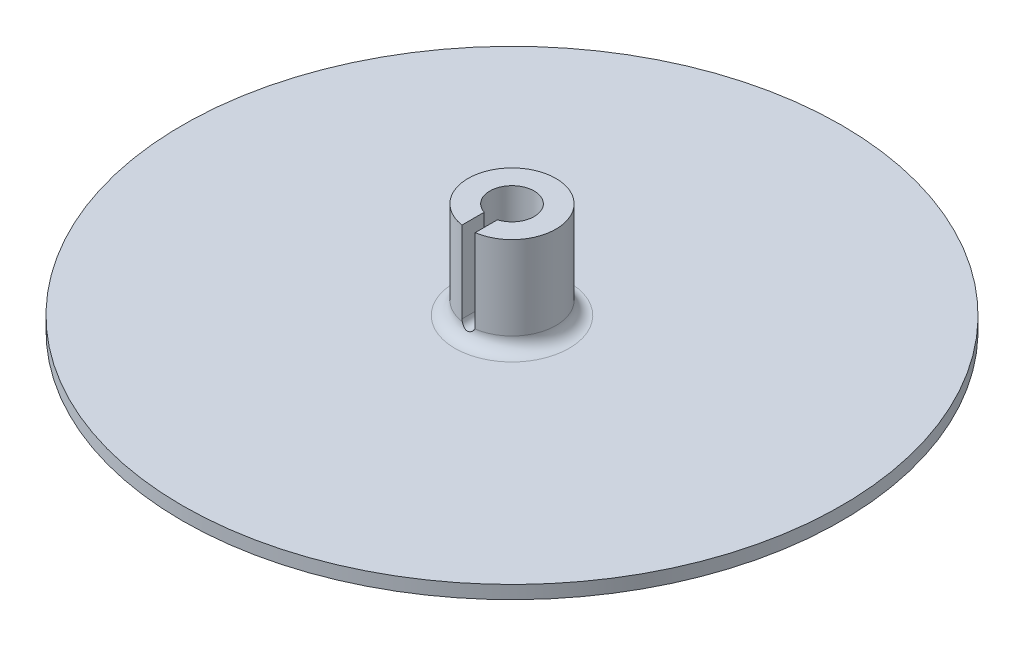
ISO-10303-21;
HEADER;
FILE_DESCRIPTION(('STEP AP214'),'2;1');
FILE_NAME('part.step','',(''),(''),'','','');
FILE_SCHEMA(('AUTOMOTIVE_DESIGN { 1 0 10303 214 1 1 1 1 }'));
ENDSEC;
DATA;
#1=APPLICATION_CONTEXT('core data for automotive mechanical design processes');
#2=APPLICATION_PROTOCOL_DEFINITION('international standard','automotive_design',2000,#1);
#3=PRODUCT_CONTEXT('',#1,'mechanical');
#4=PRODUCT('Part','Part','',(#3));
#5=PRODUCT_RELATED_PRODUCT_CATEGORY('part','',(#4));
#6=PRODUCT_DEFINITION_FORMATION('','',#4);
#7=PRODUCT_DEFINITION_CONTEXT('part definition',#1,'design');
#8=PRODUCT_DEFINITION('design','',#6,#7);
#9=PRODUCT_DEFINITION_SHAPE('','',#8);
#10=(LENGTH_UNIT() NAMED_UNIT(*) SI_UNIT(.MILLI.,.METRE.));
#11=(NAMED_UNIT(*) PLANE_ANGLE_UNIT() SI_UNIT($,.RADIAN.));
#12=(NAMED_UNIT(*) SI_UNIT($,.STERADIAN.) SOLID_ANGLE_UNIT());
#13=UNCERTAINTY_MEASURE_WITH_UNIT(LENGTH_MEASURE(1.E-05),#10,'distance_accuracy_value','');
#14=(GEOMETRIC_REPRESENTATION_CONTEXT(3) GLOBAL_UNCERTAINTY_ASSIGNED_CONTEXT((#13)) GLOBAL_UNIT_ASSIGNED_CONTEXT((#10,
#11,#12)) REPRESENTATION_CONTEXT('',''));
#15=CARTESIAN_POINT('',(0.,0.,0.));
#16=DIRECTION('',(0.,0.,1.));
#17=DIRECTION('',(1.,0.,0.));
#18=AXIS2_PLACEMENT_3D('',#15,#16,#17);
#19=CARTESIAN_POINT('',(0.,25.,0.));
#20=DIRECTION('',(0.,1.,0.));
#21=DIRECTION('',(0.,0.,1.));
#22=AXIS2_PLACEMENT_3D('',#19,#20,#21);
#23=PLANE('',#22);
#24=CARTESIAN_POINT('',(0.,25.,0.));
#25=DIRECTION('',(0.,1.,0.));
#26=DIRECTION('',(0.,0.,1.));
#27=AXIS2_PLACEMENT_3D('',#24,#25,#26);
#28=CIRCLE('',#27,10.);
#29=CARTESIAN_POINT('',(1.5,25.,9.8868599666426));
#30=VERTEX_POINT('',#29);
#31=CARTESIAN_POINT('',(-1.5,25.,9.8868599666426));
#32=VERTEX_POINT('',#31);
#33=EDGE_CURVE('E105',#30,#32,#28,.T.);
#34=ORIENTED_EDGE('',*,*,#33,.T.);
#35=DIRECTION('',(0.,0.,-1.));
#36=VECTOR('',#35,1.);
#37=CARTESIAN_POINT('',(-1.5,25.,75.));
#38=LINE('',#37,#36);
#39=CARTESIAN_POINT('',(-1.5,25.,4.82208461145177));
#40=VERTEX_POINT('',#39);
#41=EDGE_CURVE('E189',#32,#40,#38,.T.);
#42=ORIENTED_EDGE('',*,*,#41,.T.);
#43=CARTESIAN_POINT('',(0.,25.,0.));
#44=DIRECTION('',(0.,1.,0.));
#45=DIRECTION('',(0.,0.,1.));
#46=AXIS2_PLACEMENT_3D('',#43,#44,#45);
#47=CIRCLE('',#46,5.05);
#48=CARTESIAN_POINT('',(1.5,25.,4.82208461145177));
#49=VERTEX_POINT('',#48);
#50=EDGE_CURVE('E108',#49,#40,#47,.T.);
#51=ORIENTED_EDGE('',*,*,#50,.F.);
#52=DIRECTION('',(0.,0.,-1.));
#53=VECTOR('',#52,1.);
#54=CARTESIAN_POINT('',(1.5,25.,75.));
#55=LINE('',#54,#53);
#56=EDGE_CURVE('E99',#30,#49,#55,.T.);
#57=ORIENTED_EDGE('',*,*,#56,.F.);
#58=EDGE_LOOP('',(#34,#42,#51,#57));
#59=FACE_BOUND('',#58,.T.);
#60=ADVANCED_FACE('F33',(#59),#23,.T.);
#61=CARTESIAN_POINT('',(0.,25.,0.));
#62=DIRECTION('',(0.,-1.,0.));
#63=DIRECTION('',(0.,0.,-1.));
#64=AXIS2_PLACEMENT_3D('',#61,#62,#63);
#65=CYLINDRICAL_SURFACE('',#64,10.);
#66=DIRECTION('',(0.,-1.,0.));
#67=VECTOR('',#66,1.);
#68=CARTESIAN_POINT('',(-1.5,25.,9.88685996664259));
#69=LINE('',#68,#67);
#70=CARTESIAN_POINT('',(-1.5,6.5,9.88685996664259));
#71=VERTEX_POINT('',#70);
#72=EDGE_CURVE('E106',#32,#71,#69,.T.);
#73=ORIENTED_EDGE('',*,*,#72,.F.);
#74=ORIENTED_EDGE('',*,*,#33,.F.);
#75=DIRECTION('',(0.,-1.,0.));
#76=VECTOR('',#75,1.);
#77=CARTESIAN_POINT('',(1.5,25.,9.88685996664259));
#78=LINE('',#77,#76);
#79=CARTESIAN_POINT('',(1.5,6.5,9.8868599666426));
#80=VERTEX_POINT('',#79);
#81=EDGE_CURVE('E95',#80,#30,#78,.F.);
#82=ORIENTED_EDGE('',*,*,#81,.F.);
#83=CARTESIAN_POINT('',(1.4142135623731,6.,9.89949493661167));
#84=CARTESIAN_POINT('',(1.42841919297155,6.04016585919419,9.8974638851992));
#85=CARTESIAN_POINT('',(1.44090836451784,6.08094961701925,9.89565018448272));
#86=CARTESIAN_POINT('',(1.46229862087134,6.16314738232737,9.89251266828498));
#87=CARTESIAN_POINT('',(1.47122523286225,6.20455461573,9.89118537333465));
#88=CARTESIAN_POINT('',(1.48554469257614,6.28798936841882,9.88904494908769));
#89=CARTESIAN_POINT('',(1.4909375166604,6.33001689185242,9.88823182323051));
#90=CARTESIAN_POINT('',(1.49818071613181,6.4146943707577,9.8871359875291));
#91=CARTESIAN_POINT('',(1.5000047503228,6.45734663068889,9.88685722209615));
#92=CARTESIAN_POINT('',(1.5,6.5,9.88685996664259));
#93=B_SPLINE_CURVE_WITH_KNOTS('',3,(#83,#84,#85,#86,#87,#88,#89,#90,#91,#92),.UNSPECIFIED.,.F.,
.F.,(4,2,2,2,4),(0.,0.12791761598587,0.254901444701038,0.381886122846154,0.509804589424821),.UNSPECIFIED.);
#94=CARTESIAN_POINT('',(1.4142135623731,6.,9.89949493661167));
#95=VERTEX_POINT('',#94);
#96=EDGE_CURVE('E81',#95,#80,#93,.T.);
#97=ORIENTED_EDGE('',*,*,#96,.F.);
#98=CARTESIAN_POINT('',(0.,6.,0.));
#99=DIRECTION('',(0.,1.,0.));
#100=DIRECTION('',(0.,0.,1.));
#101=AXIS2_PLACEMENT_3D('',#98,#99,#100);
#102=CIRCLE('',#101,10.);
#103=CARTESIAN_POINT('',(-1.41421356237309,6.,9.89949493661167));
#104=VERTEX_POINT('',#103);
#105=EDGE_CURVE('E130',#95,#104,#102,.T.);
#106=ORIENTED_EDGE('',*,*,#105,.T.);
#107=CARTESIAN_POINT('',(-1.5,6.5,9.88685996664259));
#108=CARTESIAN_POINT('',(-1.50000475032279,6.45734663068889,9.88685722209615));
#109=CARTESIAN_POINT('',(-1.49818071613181,6.4146943707577,9.8871359875291));
#110=CARTESIAN_POINT('',(-1.49093751666039,6.33001689185242,9.88823182323051));
#111=CARTESIAN_POINT('',(-1.48554469257614,6.28798936841882,9.88904494908769));
#112=CARTESIAN_POINT('',(-1.47122523286225,6.20455461573,9.89118537333466));
#113=CARTESIAN_POINT('',(-1.46229862087134,6.16314738232737,9.89251266828498));
#114=CARTESIAN_POINT('',(-1.44090836451783,6.08094961701925,9.89565018448272));
#115=CARTESIAN_POINT('',(-1.42841919297154,6.04016585919419,9.8974638851992));
#116=CARTESIAN_POINT('',(-1.41421356237309,6.,9.89949493661167));
#117=B_SPLINE_CURVE_WITH_KNOTS('',3,(#107,#108,#109,#110,#111,#112,#113,#114,#115,#116),
.UNSPECIFIED.,.F.,.F.,(4,2,2,2,4),(0.,0.127918466578666,0.254903144723783,0.381886973438951,
0.509804589424821),.UNSPECIFIED.);
#118=EDGE_CURVE('E50',#71,#104,#117,.T.);
#119=ORIENTED_EDGE('',*,*,#118,.F.);
#120=EDGE_LOOP('',(#73,#74,#82,#97,#106,#119));
#121=FACE_BOUND('',#120,.T.);
#122=ADVANCED_FACE('F103',(#121),#65,.T.);
#123=CARTESIAN_POINT('',(0.,25.,0.));
#124=DIRECTION('',(0.,-1.,0.));
#125=DIRECTION('',(0.,0.,-1.));
#126=AXIS2_PLACEMENT_3D('',#123,#124,#125);
#127=CYLINDRICAL_SURFACE('',#126,5.05);
#128=CARTESIAN_POINT('',(0.,3.,0.));
#129=DIRECTION('',(0.,1.,0.));
#130=DIRECTION('',(0.,0.,1.));
#131=AXIS2_PLACEMENT_3D('',#128,#129,#130);
#132=CIRCLE('',#131,5.05);
#133=CARTESIAN_POINT('',(0.,3.,5.05));
#134=VERTEX_POINT('',#133);
#135=EDGE_CURVE('E125',#134,#134,#132,.F.);
#136=ORIENTED_EDGE('',*,*,#135,.T.);
#137=EDGE_LOOP('',(#136));
#138=FACE_BOUND('',#137,.T.);
#139=ORIENTED_EDGE('',*,*,#50,.T.);
#140=DIRECTION('',(0.,-1.,0.));
#141=VECTOR('',#140,1.);
#142=CARTESIAN_POINT('',(-1.5,25.,4.82208461145177));
#143=LINE('',#142,#141);
#144=CARTESIAN_POINT('',(-1.5,6.5,4.82208461145178));
#145=VERTEX_POINT('',#144);
#146=EDGE_CURVE('E11',#40,#145,#143,.T.);
#147=ORIENTED_EDGE('',*,*,#146,.T.);
#148=CARTESIAN_POINT('',(-1.5,6.5,4.82208461145178));
#149=CARTESIAN_POINT('',(-1.50000083113393,6.45880021036658,4.82208114095214));
#150=CARTESIAN_POINT('',(-1.49830148985582,6.41762115105425,4.82261329667609));
#151=CARTESIAN_POINT('',(-1.49152941200435,6.3355769487996,4.82471333733768));
#152=CARTESIAN_POINT('',(-1.4864574213053,6.29471173846925,4.82628099327));
#153=CARTESIAN_POINT('',(-1.4662672646696,6.17324184390769,4.83247036073428));
#154=CARTESIAN_POINT('',(-1.44617448514634,6.09348139109429,4.83857894888266));
#155=CARTESIAN_POINT('',(-1.39341281883227,5.93866328107021,4.85403390578543));
#156=CARTESIAN_POINT('',(-1.36074812347342,5.8636040661708,4.86337919533124));
#157=CARTESIAN_POINT('',(-1.2838235735082,5.71997772606621,4.88424823575082));
#158=CARTESIAN_POINT('',(-1.23955846920151,5.65141355933378,4.89577297226213));
#159=CARTESIAN_POINT('',(-1.13923445421656,5.5206505997195,4.92009916745428));
#160=CARTESIAN_POINT('',(-1.08288076919656,5.45868297246623,4.93292728818376));
#161=CARTESIAN_POINT('',(-0.96060720524951,5.34492068382514,4.95818776011715));
#162=CARTESIAN_POINT('',(-0.894685719882666,5.29312773421591,4.97062004443158));
#163=CARTESIAN_POINT('',(-0.753499488398171,5.20018355693814,4.99399170110133));
#164=CARTESIAN_POINT('',(-0.678072672041147,5.1592688738011,5.00489577354421));
#165=CARTESIAN_POINT('',(-0.521033737298645,5.09079588673565,5.02367061587903));
#166=CARTESIAN_POINT('',(-0.439423195338829,5.06323419187082,5.03154215576602));
#167=CARTESIAN_POINT('',(-0.274761638105901,5.02301464392478,5.04317598620987));
#168=CARTESIAN_POINT('',(-0.191815344013148,5.00996019178055,5.04704741153989));
#169=CARTESIAN_POINT('',(-0.0248238071827555,4.9978721191848,5.05062892909833));
#170=CARTESIAN_POINT('',(0.059221229127352,4.99883590181252,5.05033979208373));
#171=CARTESIAN_POINT('',(0.223240886422194,5.01449006325889,5.04571000416911));
#172=CARTESIAN_POINT('',(0.303260654722891,5.02875080240631,5.0414961693844));
#173=CARTESIAN_POINT('',(0.45971438764924,5.06989277604024,5.02964423703177));
#174=CARTESIAN_POINT('',(0.536148165504498,5.09677466707776,5.02200596132573));
#175=CARTESIAN_POINT('',(0.684290222124004,5.16269052408165,5.00398680727789));
#176=CARTESIAN_POINT('',(0.755933956718131,5.20186084841235,4.99357536252797));
#177=CARTESIAN_POINT('',(0.891768780147766,5.29113382804221,4.97111608758135));
#178=CARTESIAN_POINT('',(0.955958226917691,5.34123888512319,4.95906789809832));
#179=CARTESIAN_POINT('',(1.07762166302624,5.45318587148777,4.93408925495036));
#180=CARTESIAN_POINT('',(1.13475094534282,5.51539927529572,4.92114266459012));
#181=CARTESIAN_POINT('',(1.23787326290002,5.64866653032094,4.89622227592338));
#182=CARTESIAN_POINT('',(1.28386307041372,5.71972293484168,4.88424876023705));
#183=CARTESIAN_POINT('',(1.36375684651581,5.8695646559276,4.86255117944283));
#184=CARTESIAN_POINT('',(1.39753858215453,5.94841858636755,4.85285018932225));
#185=CARTESIAN_POINT('',(1.45120180384091,6.1110080353834,4.83707644462356));
#186=CARTESIAN_POINT('',(1.47110450722522,6.19473588975919,4.83099815398125));
#187=CARTESIAN_POINT('',(1.48913579644576,6.31603576786345,4.82545326192492));
#188=CARTESIAN_POINT('',(1.4932094742528,6.35272606915173,4.82419275325381));
#189=CARTESIAN_POINT('',(1.49863910020369,6.42627140138811,4.82250834680984));
#190=CARTESIAN_POINT('',(1.49999907805143,6.46312610651307,4.8220832085695));
#191=CARTESIAN_POINT('',(1.5,6.5,4.82208461145177));
#192=B_SPLINE_CURVE_WITH_KNOTS('',3,(#148,#149,#150,#151,#152,#153,#154,#155,#156,#157,#158,
#159,#160,#161,#162,#163,#164,#165,#166,#167,#168,#169,#170,#171,#172,#173,#174,#175,#176,#177,
#178,#179,#180,#181,#182,#183,#184,#185,#186,#187,#188,#189,#190,#191),.UNSPECIFIED.,.F.,.F.,(4,
2,2,2,2,2,2,2,2,2,2,2,2,2,2,2,2,2,2,2,2,4),(0.,0.123520293443045,0.247013278982539,
0.493165886849912,0.739236499304448,0.985418662516604,1.23847415475121,1.49157218442165,
1.74979170029462,2.00794560796788,2.25885381637513,2.50971554386333,2.75274253057542,
2.99578216092711,3.24162021627833,3.48751232367817,3.74268099875394,3.99792352220966,
4.25565513435547,4.51299187475599,4.6237126569851,4.73426890186612),.UNSPECIFIED.);
#193=CARTESIAN_POINT('',(1.5,6.5,4.82208461145177));
#194=VERTEX_POINT('',#193);
#195=EDGE_CURVE('E91',#145,#194,#192,.T.);
#196=ORIENTED_EDGE('',*,*,#195,.T.);
#197=DIRECTION('',(0.,-1.,0.));
#198=VECTOR('',#197,1.);
#199=CARTESIAN_POINT('',(1.5,25.,4.82208461145177));
#200=LINE('',#199,#198);
#201=EDGE_CURVE('E43',#194,#49,#200,.F.);
#202=ORIENTED_EDGE('',*,*,#201,.T.);
#203=EDGE_LOOP('',(#139,#147,#196,#202));
#204=FACE_BOUND('',#203,.T.);
#205=ADVANCED_FACE('F165',(#138,#204),#127,.F.);
#206=CARTESIAN_POINT('',(0.,6.,0.));
#207=DIRECTION('',(0.,1.,0.));
#208=DIRECTION('',(0.,0.,1.));
#209=AXIS2_PLACEMENT_3D('',#206,#207,#208);
#210=TOROIDAL_SURFACE('',#209,13.,3.);
#211=CARTESIAN_POINT('',(0.,3.,0.));
#212=DIRECTION('',(0.,1.,0.));
#213=DIRECTION('',(0.,0.,1.));
#214=AXIS2_PLACEMENT_3D('',#211,#212,#213);
#215=CIRCLE('',#214,13.);
#216=CARTESIAN_POINT('',(0.,3.,13.));
#217=VERTEX_POINT('',#216);
#218=EDGE_CURVE('E132',#217,#217,#215,.F.);
#219=ORIENTED_EDGE('',*,*,#218,.F.);
#220=EDGE_LOOP('',(#219));
#221=FACE_BOUND('',#220,.T.);
#222=CARTESIAN_POINT('',(-1.4142842571421,6.0002,9.89948484383573));
#223=CARTESIAN_POINT('',(-1.40060480515787,5.9614843709103,9.90143226526426));
#224=CARTESIAN_POINT('',(-1.38535647512993,5.92340510075655,9.90434095059942));
#225=CARTESIAN_POINT('',(-1.35188374135329,5.84878546790682,9.91182889951746));
#226=CARTESIAN_POINT('',(-1.3336618830547,5.81224382230925,9.91640673834471));
#227=CARTESIAN_POINT('',(-1.27494708148976,5.70560431855961,9.93221841420121));
#228=CARTESIAN_POINT('',(-1.23025682025258,5.6380772685519,9.9455563769499));
#229=CARTESIAN_POINT('',(-1.13127254345632,5.51173921922514,9.97549868000922));
#230=CARTESIAN_POINT('',(-1.07700602350915,5.45290412891045,9.99209368352703));
#231=CARTESIAN_POINT('',(-0.959919333410373,5.34461202366505,10.0262739045994));
#232=CARTESIAN_POINT('',(-0.897085911497275,5.2951698274809,10.0438606309938));
#233=CARTESIAN_POINT('',(-0.75920743245176,5.2034852329578,10.0789623106131));
#234=CARTESIAN_POINT('',(-0.683604425533763,5.16203832460585,10.096377126458));
#235=CARTESIAN_POINT('',(-0.52571456648518,5.09250222462331,10.1269949538265));
#236=CARTESIAN_POINT('',(-0.443433220436748,5.0644021573282,10.140201391646));
#237=CARTESIAN_POINT('',(-0.277967962078202,5.02362366582018,10.1597749555894));
#238=CARTESIAN_POINT('',(-0.194961571734607,5.01035642877221,10.1664019441546));
#239=CARTESIAN_POINT('',(-0.0276544944238265,4.99791462333012,10.1726080872463));
#240=CARTESIAN_POINT('',(0.0566454347636087,4.99873209676839,10.1721912217063));
#241=CARTESIAN_POINT('',(0.215908030638047,5.01366494786572,10.1647616050232));
#242=CARTESIAN_POINT('',(0.291019113663042,5.02655636316445,10.1583560461505));
#243=CARTESIAN_POINT('',(0.437891905022995,5.06334248259628,10.140721993753));
#244=CARTESIAN_POINT('',(0.50965295690038,5.08723933342155,10.129492559324));
#245=CARTESIAN_POINT('',(0.65053429965542,5.14617939646366,10.1032331240305));
#246=CARTESIAN_POINT('',(0.719489824955033,5.18156373031601,10.0880901522306));
#247=CARTESIAN_POINT('',(0.850918831290719,5.26230312309961,10.0560977947511));
#248=CARTESIAN_POINT('',(0.913385976354351,5.30766779565804,10.0392467722786));
#249=CARTESIAN_POINT('',(1.0366656264176,5.41256019935839,10.0041871297365));
#250=CARTESIAN_POINT('',(1.09666563055016,5.47305846895193,9.98601446131202));
#251=CARTESIAN_POINT('',(1.20584202550895,5.60380383672188,9.95292194643777));
#252=CARTESIAN_POINT('',(1.25504029703453,5.67403074806011,9.93799552476742));
#253=CARTESIAN_POINT('',(1.32113891946382,5.78815639079217,9.91965846163283));
#254=CARTESIAN_POINT('',(1.34245212120577,5.82920665637699,9.91411482094646));
#255=CARTESIAN_POINT('',(1.38127745055326,5.91329693337138,9.9051294708537));
#256=CARTESIAN_POINT('',(1.39878854571011,5.95633748139617,9.90168833191529));
#257=CARTESIAN_POINT('',(1.41428425714211,6.0002,9.89948484383573));
#258=B_SPLINE_CURVE_WITH_KNOTS('',3,(#222,#223,#224,#225,#226,#227,#228,#229,#230,#231,#232,
#233,#234,#235,#236,#237,#238,#239,#240,#241,#242,#243,#244,#245,#246,#247,#248,#249,#250,#251,
#252,#253,#254,#255,#256,#257),.UNSPECIFIED.,.F.,.F.,(4,2,2,2,2,2,2,2,2,2,2,2,2,2,2,2,2,4),(0.,
0.123220809219006,0.246336684939518,0.491264222404226,0.73549963208605,0.980117218033315,
1.24270076491599,1.5050699771325,1.75660676586695,2.00800143551067,2.23638676226301,
2.46481665615475,2.70076839659846,2.93694842207608,3.19711723572144,3.4567540697702,
3.59628686897101,3.7358575105578),.UNSPECIFIED.);
#259=EDGE_CURVE('E86',#104,#95,#258,.T.);
#260=ORIENTED_EDGE('',*,*,#259,.F.);
#261=ORIENTED_EDGE('',*,*,#105,.F.);
#262=EDGE_LOOP('',(#260,#261));
#263=FACE_BOUND('',#262,.T.);
#264=ADVANCED_FACE('F35',(#221,#263),#210,.F.);
#265=CARTESIAN_POINT('',(0.,3.,0.));
#266=DIRECTION('',(0.,-1.,0.));
#267=DIRECTION('',(0.,0.,-1.));
#268=AXIS2_PLACEMENT_3D('',#265,#266,#267);
#269=CYLINDRICAL_SURFACE('',#268,75.);
#270=CARTESIAN_POINT('',(0.,3.,0.));
#271=DIRECTION('',(0.,1.,0.));
#272=DIRECTION('',(0.,0.,1.));
#273=AXIS2_PLACEMENT_3D('',#270,#271,#272);
#274=CIRCLE('',#273,75.);
#275=CARTESIAN_POINT('',(0.,3.,75.));
#276=VERTEX_POINT('',#275);
#277=EDGE_CURVE('E122',#276,#276,#274,.T.);
#278=ORIENTED_EDGE('',*,*,#277,.F.);
#279=EDGE_LOOP('',(#278));
#280=FACE_BOUND('',#279,.T.);
#281=CARTESIAN_POINT('',(0.,0.,0.));
#282=DIRECTION('',(0.,1.,0.));
#283=DIRECTION('',(0.,0.,1.));
#284=AXIS2_PLACEMENT_3D('',#281,#282,#283);
#285=CIRCLE('',#284,75.);
#286=CARTESIAN_POINT('',(0.,0.,75.));
#287=VERTEX_POINT('',#286);
#288=EDGE_CURVE('E121',#287,#287,#285,.T.);
#289=ORIENTED_EDGE('',*,*,#288,.T.);
#290=EDGE_LOOP('',(#289));
#291=FACE_BOUND('',#290,.T.);
#292=ADVANCED_FACE('F171',(#280,#291),#269,.T.);
#293=CARTESIAN_POINT('',(0.,3.,0.));
#294=DIRECTION('',(0.,1.,0.));
#295=DIRECTION('',(0.,0.,1.));
#296=AXIS2_PLACEMENT_3D('',#293,#294,#295);
#297=PLANE('',#296);
#298=ORIENTED_EDGE('',*,*,#218,.T.);
#299=EDGE_LOOP('',(#298));
#300=FACE_BOUND('',#299,.T.);
#301=ORIENTED_EDGE('',*,*,#277,.T.);
#302=EDGE_LOOP('',(#301));
#303=FACE_BOUND('',#302,.T.);
#304=ADVANCED_FACE('F166',(#300,#303),#297,.T.);
#305=CARTESIAN_POINT('',(0.,0.,0.));
#306=DIRECTION('',(0.,1.,0.));
#307=DIRECTION('',(0.,0.,1.));
#308=AXIS2_PLACEMENT_3D('',#305,#306,#307);
#309=PLANE('',#308);
#310=CARTESIAN_POINT('',(0.,0.,0.));
#311=DIRECTION('',(0.,-1.,0.));
#312=DIRECTION('',(0.,0.,-1.));
#313=AXIS2_PLACEMENT_3D('',#310,#311,#312);
#314=CIRCLE('',#313,3.47);
#315=CARTESIAN_POINT('',(0.,0.,-3.47));
#316=VERTEX_POINT('',#315);
#317=EDGE_CURVE('E217',#316,#316,#314,.T.);
#318=ORIENTED_EDGE('',*,*,#317,.F.);
#319=EDGE_LOOP('',(#318));
#320=FACE_BOUND('',#319,.T.);
#321=ORIENTED_EDGE('',*,*,#288,.F.);
#322=EDGE_LOOP('',(#321));
#323=FACE_BOUND('',#322,.T.);
#324=ADVANCED_FACE('F170',(#320,#323),#309,.F.);
#325=CARTESIAN_POINT('',(0.,3.,0.));
#326=DIRECTION('',(0.,1.,0.));
#327=DIRECTION('',(0.,0.,1.));
#328=AXIS2_PLACEMENT_3D('',#325,#326,#327);
#329=CIRCLE('',#328,1.8);
#330=CARTESIAN_POINT('',(0.,3.,1.8));
#331=VERTEX_POINT('',#330);
#332=EDGE_CURVE('E38',#331,#331,#329,.T.);
#333=ORIENTED_EDGE('',*,*,#332,.F.);
#334=EDGE_LOOP('',(#333));
#335=FACE_BOUND('',#334,.T.);
#336=ORIENTED_EDGE('',*,*,#135,.F.);
#337=EDGE_LOOP('',(#336));
#338=FACE_BOUND('',#337,.T.);
#339=ADVANCED_FACE('F173',(#335,#338),#297,.T.);
#340=CARTESIAN_POINT('',(-1.5,25.,75.));
#341=DIRECTION('',(1.,0.,0.));
#342=DIRECTION('',(0.,1.,0.));
#343=AXIS2_PLACEMENT_3D('',#340,#341,#342);
#344=PLANE('',#343);
#345=ORIENTED_EDGE('',*,*,#72,.T.);
#346=DIRECTION('',(0.,0.,-1.));
#347=VECTOR('',#346,1.);
#348=CARTESIAN_POINT('',(-1.5,6.5,75.));
#349=LINE('',#348,#347);
#350=EDGE_CURVE('E98',#71,#145,#349,.T.);
#351=ORIENTED_EDGE('',*,*,#350,.T.);
#352=ORIENTED_EDGE('',*,*,#146,.F.);
#353=ORIENTED_EDGE('',*,*,#41,.F.);
#354=EDGE_LOOP('',(#345,#351,#352,#353));
#355=FACE_BOUND('',#354,.T.);
#356=ADVANCED_FACE('F146',(#355),#344,.T.);
#357=CARTESIAN_POINT('',(1.5,25.,75.));
#358=DIRECTION('',(-1.,0.,0.));
#359=DIRECTION('',(0.,-1.,0.));
#360=AXIS2_PLACEMENT_3D('',#357,#358,#359);
#361=PLANE('',#360);
#362=ORIENTED_EDGE('',*,*,#81,.T.);
#363=ORIENTED_EDGE('',*,*,#56,.T.);
#364=ORIENTED_EDGE('',*,*,#201,.F.);
#365=DIRECTION('',(0.,0.,-1.));
#366=VECTOR('',#365,1.);
#367=CARTESIAN_POINT('',(1.5,6.5,75.));
#368=LINE('',#367,#366);
#369=EDGE_CURVE('E84',#80,#194,#368,.T.);
#370=ORIENTED_EDGE('',*,*,#369,.F.);
#371=EDGE_LOOP('',(#362,#363,#364,#370));
#372=FACE_BOUND('',#371,.T.);
#373=ADVANCED_FACE('F94',(#372),#361,.T.);
#374=CARTESIAN_POINT('',(0.,6.5,75.));
#375=DIRECTION('',(0.,0.,-1.));
#376=DIRECTION('',(-1.,0.,0.));
#377=AXIS2_PLACEMENT_3D('',#374,#375,#376);
#378=CYLINDRICAL_SURFACE('',#377,1.5);
#379=ORIENTED_EDGE('',*,*,#350,.F.);
#380=ORIENTED_EDGE('',*,*,#118,.T.);
#381=ORIENTED_EDGE('',*,*,#259,.T.);
#382=ORIENTED_EDGE('',*,*,#96,.T.);
#383=ORIENTED_EDGE('',*,*,#369,.T.);
#384=ORIENTED_EDGE('',*,*,#195,.F.);
#385=EDGE_LOOP('',(#379,#380,#381,#382,#383,#384));
#386=FACE_BOUND('',#385,.T.);
#387=ADVANCED_FACE('F83',(#386),#378,.F.);
#388=CARTESIAN_POINT('',(0.,0.,0.));
#389=DIRECTION('',(0.,-1.,0.));
#390=DIRECTION('',(0.,0.,-1.));
#391=AXIS2_PLACEMENT_3D('',#388,#389,#390);
#392=CYLINDRICAL_SURFACE('',#391,1.8);
#393=ORIENTED_EDGE('',*,*,#332,.T.);
#394=EDGE_LOOP('',(#393));
#395=FACE_BOUND('',#394,.T.);
#396=CARTESIAN_POINT('',(0.,1.67,0.));
#397=DIRECTION('',(0.,-1.,0.));
#398=DIRECTION('',(0.,0.,-1.));
#399=AXIS2_PLACEMENT_3D('',#396,#397,#398);
#400=CIRCLE('',#399,1.8);
#401=CARTESIAN_POINT('',(0.,1.67,-1.8));
#402=VERTEX_POINT('',#401);
#403=EDGE_CURVE('E192',#402,#402,#400,.T.);
#404=ORIENTED_EDGE('',*,*,#403,.T.);
#405=EDGE_LOOP('',(#404));
#406=FACE_BOUND('',#405,.T.);
#407=ADVANCED_FACE('F144',(#395,#406),#392,.F.);
#408=CARTESIAN_POINT('',(0.,0.,0.));
#409=DIRECTION('',(0.,-1.,0.));
#410=DIRECTION('',(0.,0.,-1.));
#411=AXIS2_PLACEMENT_3D('',#408,#409,#410);
#412=CONICAL_SURFACE('',#411,3.47,0.785398163397448);
#413=ORIENTED_EDGE('',*,*,#403,.F.);
#414=EDGE_LOOP('',(#413));
#415=FACE_BOUND('',#414,.T.);
#416=ORIENTED_EDGE('',*,*,#317,.T.);
#417=EDGE_LOOP('',(#416));
#418=FACE_BOUND('',#417,.T.);
#419=ADVANCED_FACE('F213',(#415,#418),#412,.F.);
#420=CLOSED_SHELL('',(#60,#122,#205,#264,#292,#304,#324,#339,#356,#373,#387,#407,#419));
#421=MANIFOLD_SOLID_BREP('B2',#420);
#422=ADVANCED_BREP_SHAPE_REPRESENTATION('',(#18,#421),#14);
#423=SHAPE_DEFINITION_REPRESENTATION(#9,#422);
ENDSEC;
END-ISO-10303-21;
